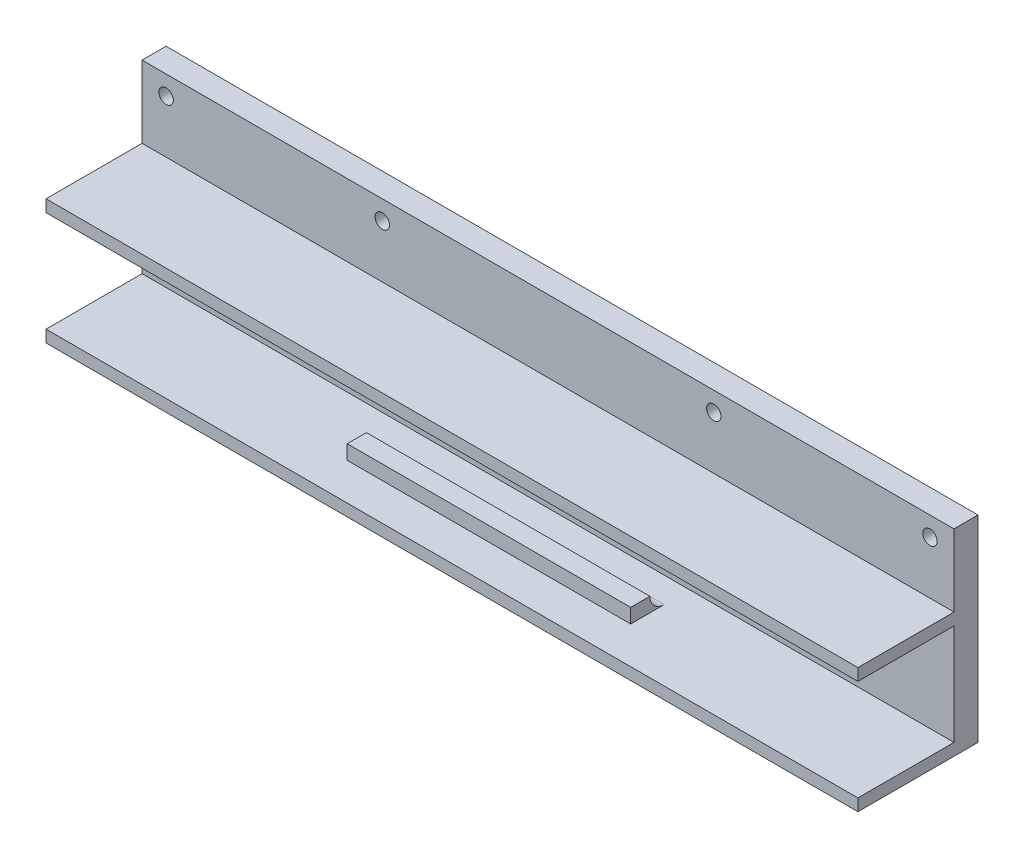
ISO-10303-21;
HEADER;
FILE_DESCRIPTION(('STEP AP214'),'2;1');
FILE_NAME('part.step','',(''),(''),'','','');
FILE_SCHEMA(('AUTOMOTIVE_DESIGN { 1 0 10303 214 1 1 1 1 }'));
ENDSEC;
DATA;
#1=APPLICATION_CONTEXT('core data for automotive mechanical design processes');
#2=APPLICATION_PROTOCOL_DEFINITION('international standard','automotive_design',2000,#1);
#3=PRODUCT_CONTEXT('',#1,'mechanical');
#4=PRODUCT('Part','Part','',(#3));
#5=PRODUCT_RELATED_PRODUCT_CATEGORY('part','',(#4));
#6=PRODUCT_DEFINITION_FORMATION('','',#4);
#7=PRODUCT_DEFINITION_CONTEXT('part definition',#1,'design');
#8=PRODUCT_DEFINITION('design','',#6,#7);
#9=PRODUCT_DEFINITION_SHAPE('','',#8);
#10=(LENGTH_UNIT() NAMED_UNIT(*) SI_UNIT(.MILLI.,.METRE.));
#11=(NAMED_UNIT(*) PLANE_ANGLE_UNIT() SI_UNIT($,.RADIAN.));
#12=(NAMED_UNIT(*) SI_UNIT($,.STERADIAN.) SOLID_ANGLE_UNIT());
#13=UNCERTAINTY_MEASURE_WITH_UNIT(LENGTH_MEASURE(1.E-05),#10,'distance_accuracy_value','');
#14=(GEOMETRIC_REPRESENTATION_CONTEXT(3) GLOBAL_UNCERTAINTY_ASSIGNED_CONTEXT((#13)) GLOBAL_UNIT_ASSIGNED_CONTEXT((#10,
#11,#12)) REPRESENTATION_CONTEXT('',''));
#15=CARTESIAN_POINT('',(0.,0.,0.));
#16=DIRECTION('',(0.,0.,1.));
#17=DIRECTION('',(1.,0.,0.));
#18=AXIS2_PLACEMENT_3D('',#15,#16,#17);
#19=CARTESIAN_POINT('',(-29.5,0.,0.));
#20=DIRECTION('',(-1.,0.,0.));
#21=DIRECTION('',(0.,0.,1.));
#22=AXIS2_PLACEMENT_3D('',#19,#20,#21);
#23=PLANE('',#22);
#24=DIRECTION('',(0.,0.,1.));
#25=VECTOR('',#24,1.);
#26=CARTESIAN_POINT('',(-29.5,0.,17.3));
#27=LINE('',#26,#25);
#28=CARTESIAN_POINT('',(-29.5,0.,13.3));
#29=VERTEX_POINT('',#28);
#30=CARTESIAN_POINT('',(-29.5,0.,17.3));
#31=VERTEX_POINT('',#30);
#32=EDGE_CURVE('E176',#29,#31,#27,.T.);
#33=ORIENTED_EDGE('',*,*,#32,.T.);
#34=DIRECTION('',(0.,1.,0.));
#35=VECTOR('',#34,1.);
#36=CARTESIAN_POINT('',(-29.5,2.99999999999998,17.3));
#37=LINE('',#36,#35);
#38=CARTESIAN_POINT('',(-29.5,2.99999999999998,17.3));
#39=VERTEX_POINT('',#38);
#40=EDGE_CURVE('E586',#31,#39,#37,.T.);
#41=ORIENTED_EDGE('',*,*,#40,.T.);
#42=DIRECTION('',(0.,0.,-1.));
#43=VECTOR('',#42,1.);
#44=CARTESIAN_POINT('',(-29.5,2.99999999999996,25.));
#45=LINE('',#44,#43);
#46=CARTESIAN_POINT('',(-29.5,2.99999999999996,10.3));
#47=VERTEX_POINT('',#46);
#48=EDGE_CURVE('E211',#39,#47,#45,.T.);
#49=ORIENTED_EDGE('',*,*,#48,.T.);
#50=CARTESIAN_POINT('',(-29.5,0.,10.3));
#51=DIRECTION('',(1.,0.,0.));
#52=DIRECTION('',(0.,0.,-1.));
#53=AXIS2_PLACEMENT_3D('',#50,#51,#52);
#54=CIRCLE('',#53,3.);
#55=EDGE_CURVE('E181',#47,#29,#54,.T.);
#56=ORIENTED_EDGE('',*,*,#55,.T.);
#57=EDGE_LOOP('',(#33,#41,#49,#56));
#58=FACE_BOUND('',#57,.T.);
#59=ADVANCED_FACE('F33',(#58),#23,.T.);
#60=CARTESIAN_POINT('',(29.5,0.,0.));
#61=DIRECTION('',(1.,0.,0.));
#62=DIRECTION('',(0.,0.,-1.));
#63=AXIS2_PLACEMENT_3D('',#60,#61,#62);
#64=PLANE('',#63);
#65=DIRECTION('',(0.,0.,1.));
#66=VECTOR('',#65,1.);
#67=CARTESIAN_POINT('',(29.5,0.,17.3));
#68=LINE('',#67,#66);
#69=CARTESIAN_POINT('',(29.5,0.,13.3));
#70=VERTEX_POINT('',#69);
#71=CARTESIAN_POINT('',(29.5,0.,17.3));
#72=VERTEX_POINT('',#71);
#73=EDGE_CURVE('E56',#70,#72,#68,.T.);
#74=ORIENTED_EDGE('',*,*,#73,.F.);
#75=CARTESIAN_POINT('',(29.5,0.,10.3));
#76=DIRECTION('',(1.,0.,0.));
#77=DIRECTION('',(0.,0.,-1.));
#78=AXIS2_PLACEMENT_3D('',#75,#76,#77);
#79=CIRCLE('',#78,3.);
#80=CARTESIAN_POINT('',(29.5,2.99999999999998,10.3));
#81=VERTEX_POINT('',#80);
#82=EDGE_CURVE('E189',#81,#70,#79,.T.);
#83=ORIENTED_EDGE('',*,*,#82,.F.);
#84=DIRECTION('',(0.,0.,1.));
#85=VECTOR('',#84,1.);
#86=CARTESIAN_POINT('',(29.5,2.99999999999998,25.));
#87=LINE('',#86,#85);
#88=CARTESIAN_POINT('',(29.5,2.99999999999998,17.3));
#89=VERTEX_POINT('',#88);
#90=EDGE_CURVE('E199',#81,#89,#87,.T.);
#91=ORIENTED_EDGE('',*,*,#90,.T.);
#92=DIRECTION('',(0.,1.,0.));
#93=VECTOR('',#92,1.);
#94=CARTESIAN_POINT('',(29.5,2.99999999999998,17.3));
#95=LINE('',#94,#93);
#96=EDGE_CURVE('E594',#72,#89,#95,.T.);
#97=ORIENTED_EDGE('',*,*,#96,.F.);
#98=EDGE_LOOP('',(#74,#83,#91,#97));
#99=FACE_BOUND('',#98,.T.);
#100=ADVANCED_FACE('F351',(#99),#64,.T.);
#101=CARTESIAN_POINT('',(-29.5,2.99999999999998,17.3));
#102=DIRECTION('',(0.,0.,-1.));
#103=DIRECTION('',(-1.,0.,0.));
#104=AXIS2_PLACEMENT_3D('',#101,#102,#103);
#105=PLANE('',#104);
#106=ORIENTED_EDGE('',*,*,#40,.F.);
#107=DIRECTION('',(1.,0.,0.));
#108=VECTOR('',#107,1.);
#109=CARTESIAN_POINT('',(-29.5,0.,17.3));
#110=LINE('',#109,#108);
#111=EDGE_CURVE('E587',#31,#72,#110,.T.);
#112=ORIENTED_EDGE('',*,*,#111,.T.);
#113=ORIENTED_EDGE('',*,*,#96,.T.);
#114=DIRECTION('',(1.,0.,0.));
#115=VECTOR('',#114,1.);
#116=CARTESIAN_POINT('',(-29.5,2.99999999999998,17.3));
#117=LINE('',#116,#115);
#118=EDGE_CURVE('E192',#39,#89,#117,.T.);
#119=ORIENTED_EDGE('',*,*,#118,.F.);
#120=EDGE_LOOP('',(#106,#112,#113,#119));
#121=FACE_BOUND('',#120,.T.);
#122=ADVANCED_FACE('F357',(#121),#105,.F.);
#123=CARTESIAN_POINT('',(0.,0.,25.));
#124=DIRECTION('',(0.,0.,-1.));
#125=DIRECTION('',(-1.,0.,0.));
#126=AXIS2_PLACEMENT_3D('',#123,#124,#125);
#127=PLANE('',#126);
#128=DIRECTION('',(-1.,0.,0.));
#129=VECTOR('',#128,1.);
#130=CARTESIAN_POINT('',(-29.5,2.99999999999996,25.));
#131=LINE('',#130,#129);
#132=CARTESIAN_POINT('',(84.5,2.99999999999998,25.));
#133=VERTEX_POINT('',#132);
#134=CARTESIAN_POINT('',(-84.5,2.99999999999996,25.));
#135=VERTEX_POINT('',#134);
#136=EDGE_CURVE('E216',#133,#135,#131,.T.);
#137=ORIENTED_EDGE('',*,*,#136,.F.);
#138=DIRECTION('',(0.,1.,0.));
#139=VECTOR('',#138,1.);
#140=CARTESIAN_POINT('',(84.5,-20.5,25.));
#141=LINE('',#140,#139);
#142=CARTESIAN_POINT('',(84.5,5.49999999999998,25.));
#143=VERTEX_POINT('',#142);
#144=EDGE_CURVE('E239',#133,#143,#141,.T.);
#145=ORIENTED_EDGE('',*,*,#144,.T.);
#146=DIRECTION('',(-1.,0.,0.));
#147=VECTOR('',#146,1.);
#148=CARTESIAN_POINT('',(-84.5,5.49999999999996,25.));
#149=LINE('',#148,#147);
#150=CARTESIAN_POINT('',(-84.5,5.49999999999996,25.));
#151=VERTEX_POINT('',#150);
#152=EDGE_CURVE('E243',#143,#151,#149,.T.);
#153=ORIENTED_EDGE('',*,*,#152,.T.);
#154=DIRECTION('',(0.,-1.,0.));
#155=VECTOR('',#154,1.);
#156=CARTESIAN_POINT('',(-84.5,-20.5,25.));
#157=LINE('',#156,#155);
#158=EDGE_CURVE('E232',#151,#135,#157,.T.);
#159=ORIENTED_EDGE('',*,*,#158,.T.);
#160=EDGE_LOOP('',(#137,#145,#153,#159));
#161=FACE_BOUND('',#160,.T.);
#162=ADVANCED_FACE('F334',(#161),#127,.F.);
#163=CARTESIAN_POINT('',(0.,0.,5.));
#164=DIRECTION('',(0.,0.,-1.));
#165=DIRECTION('',(-1.,0.,0.));
#166=AXIS2_PLACEMENT_3D('',#163,#164,#165);
#167=PLANE('',#166);
#168=CARTESIAN_POINT('',(-79.5,16.5,5.));
#169=DIRECTION('',(0.,0.,1.));
#170=DIRECTION('',(1.,0.,0.));
#171=AXIS2_PLACEMENT_3D('',#168,#169,#170);
#172=CIRCLE('',#171,1.5);
#173=CARTESIAN_POINT('',(-78.,16.5,5.));
#174=VERTEX_POINT('',#173);
#175=EDGE_CURVE('E253',#174,#174,#172,.T.);
#176=ORIENTED_EDGE('',*,*,#175,.F.);
#177=EDGE_LOOP('',(#176));
#178=FACE_BOUND('',#177,.T.);
#179=CARTESIAN_POINT('',(-34.5,16.5,5.));
#180=DIRECTION('',(0.,0.,1.));
#181=DIRECTION('',(1.,0.,0.));
#182=AXIS2_PLACEMENT_3D('',#179,#180,#181);
#183=CIRCLE('',#182,1.5);
#184=CARTESIAN_POINT('',(-33.,16.5,5.));
#185=VERTEX_POINT('',#184);
#186=EDGE_CURVE('E270',#185,#185,#183,.T.);
#187=ORIENTED_EDGE('',*,*,#186,.F.);
#188=EDGE_LOOP('',(#187));
#189=FACE_BOUND('',#188,.T.);
#190=CARTESIAN_POINT('',(34.5,16.5,5.));
#191=DIRECTION('',(0.,0.,1.));
#192=DIRECTION('',(1.,0.,0.));
#193=AXIS2_PLACEMENT_3D('',#190,#191,#192);
#194=CIRCLE('',#193,1.5);
#195=CARTESIAN_POINT('',(36.,16.5,5.));
#196=VERTEX_POINT('',#195);
#197=EDGE_CURVE('E264',#196,#196,#194,.T.);
#198=ORIENTED_EDGE('',*,*,#197,.F.);
#199=EDGE_LOOP('',(#198));
#200=FACE_BOUND('',#199,.T.);
#201=CARTESIAN_POINT('',(79.5,16.5,5.));
#202=DIRECTION('',(0.,0.,1.));
#203=DIRECTION('',(1.,0.,0.));
#204=AXIS2_PLACEMENT_3D('',#201,#202,#203);
#205=CIRCLE('',#204,1.5);
#206=CARTESIAN_POINT('',(81.,16.5,5.));
#207=VERTEX_POINT('',#206);
#208=EDGE_CURVE('E258',#207,#207,#205,.T.);
#209=ORIENTED_EDGE('',*,*,#208,.F.);
#210=EDGE_LOOP('',(#209));
#211=FACE_BOUND('',#210,.T.);
#212=DIRECTION('',(-1.,0.,0.));
#213=VECTOR('',#212,1.);
#214=CARTESIAN_POINT('',(-84.5,5.49999999999996,5.));
#215=LINE('',#214,#213);
#216=CARTESIAN_POINT('',(84.5,5.49999999999997,5.));
#217=VERTEX_POINT('',#216);
#218=CARTESIAN_POINT('',(-84.5,5.49999999999996,5.));
#219=VERTEX_POINT('',#218);
#220=EDGE_CURVE('E226',#217,#219,#215,.T.);
#221=ORIENTED_EDGE('',*,*,#220,.F.);
#222=DIRECTION('',(0.,1.,0.));
#223=VECTOR('',#222,1.);
#224=CARTESIAN_POINT('',(84.5,-20.5,5.));
#225=LINE('',#224,#223);
#226=CARTESIAN_POINT('',(84.5,20.5,5.));
#227=VERTEX_POINT('',#226);
#228=EDGE_CURVE('E278',#217,#227,#225,.T.);
#229=ORIENTED_EDGE('',*,*,#228,.T.);
#230=DIRECTION('',(-1.,0.,0.));
#231=VECTOR('',#230,1.);
#232=CARTESIAN_POINT('',(-84.5,20.5,5.));
#233=LINE('',#232,#231);
#234=CARTESIAN_POINT('',(-84.5,20.5,5.));
#235=VERTEX_POINT('',#234);
#236=EDGE_CURVE('E280',#227,#235,#233,.T.);
#237=ORIENTED_EDGE('',*,*,#236,.T.);
#238=DIRECTION('',(0.,-1.,0.));
#239=VECTOR('',#238,1.);
#240=CARTESIAN_POINT('',(-84.5,-20.5,5.));
#241=LINE('',#240,#239);
#242=EDGE_CURVE('E283',#235,#219,#241,.T.);
#243=ORIENTED_EDGE('',*,*,#242,.T.);
#244=EDGE_LOOP('',(#221,#229,#237,#243));
#245=FACE_BOUND('',#244,.T.);
#246=ADVANCED_FACE('F342',(#178,#189,#200,#211,#245),#167,.F.);
#247=CARTESIAN_POINT('',(84.5,-20.5,5.));
#248=DIRECTION('',(-1.,0.,0.));
#249=DIRECTION('',(0.,0.,1.));
#250=AXIS2_PLACEMENT_3D('',#247,#248,#249);
#251=PLANE('',#250);
#252=ORIENTED_EDGE('',*,*,#144,.F.);
#253=DIRECTION('',(0.,0.,1.));
#254=VECTOR('',#253,1.);
#255=CARTESIAN_POINT('',(84.5,2.99999999999998,25.));
#256=LINE('',#255,#254);
#257=CARTESIAN_POINT('',(84.5,2.99999999999998,5.));
#258=VERTEX_POINT('',#257);
#259=EDGE_CURVE('E200',#258,#133,#256,.T.);
#260=ORIENTED_EDGE('',*,*,#259,.F.);
#261=DIRECTION('',(0.,1.,0.));
#262=VECTOR('',#261,1.);
#263=CARTESIAN_POINT('',(84.5,2.99999999999998,5.));
#264=LINE('',#263,#262);
#265=CARTESIAN_POINT('',(84.5,-18.,4.99999999999999));
#266=VERTEX_POINT('',#265);
#267=EDGE_CURVE('E206',#266,#258,#264,.T.);
#268=ORIENTED_EDGE('',*,*,#267,.F.);
#269=DIRECTION('',(0.,0.,-1.));
#270=VECTOR('',#269,1.);
#271=CARTESIAN_POINT('',(84.5,-18.,25.));
#272=LINE('',#271,#270);
#273=CARTESIAN_POINT('',(84.5,-18.,25.));
#274=VERTEX_POINT('',#273);
#275=EDGE_CURVE('E194',#274,#266,#272,.T.);
#276=ORIENTED_EDGE('',*,*,#275,.F.);
#277=CARTESIAN_POINT('',(84.5,-20.5,25.));
#278=VERTEX_POINT('',#277);
#279=EDGE_CURVE('E240',#278,#274,#141,.T.);
#280=ORIENTED_EDGE('',*,*,#279,.F.);
#281=DIRECTION('',(0.,0.,-1.));
#282=VECTOR('',#281,1.);
#283=CARTESIAN_POINT('',(84.5,-20.5,5.));
#284=LINE('',#283,#282);
#285=CARTESIAN_POINT('',(84.5,-20.5,0.));
#286=VERTEX_POINT('',#285);
#287=EDGE_CURVE('E285',#278,#286,#284,.T.);
#288=ORIENTED_EDGE('',*,*,#287,.T.);
#289=DIRECTION('',(0.,1.,0.));
#290=VECTOR('',#289,1.);
#291=CARTESIAN_POINT('',(84.5,-20.5,0.));
#292=LINE('',#291,#290);
#293=CARTESIAN_POINT('',(84.5,20.5,0.));
#294=VERTEX_POINT('',#293);
#295=EDGE_CURVE('E257',#286,#294,#292,.T.);
#296=ORIENTED_EDGE('',*,*,#295,.T.);
#297=DIRECTION('',(0.,0.,-1.));
#298=VECTOR('',#297,1.);
#299=CARTESIAN_POINT('',(84.5,20.5,5.));
#300=LINE('',#299,#298);
#301=EDGE_CURVE('E11',#227,#294,#300,.T.);
#302=ORIENTED_EDGE('',*,*,#301,.F.);
#303=ORIENTED_EDGE('',*,*,#228,.F.);
#304=DIRECTION('',(0.,0.,-1.));
#305=VECTOR('',#304,1.);
#306=CARTESIAN_POINT('',(84.5,5.49999999999998,25.));
#307=LINE('',#306,#305);
#308=EDGE_CURVE('E250',#143,#217,#307,.T.);
#309=ORIENTED_EDGE('',*,*,#308,.F.);
#310=EDGE_LOOP('',(#252,#260,#268,#276,#280,#288,#296,#302,#303,#309));
#311=FACE_BOUND('',#310,.T.);
#312=ADVANCED_FACE('F35',(#311),#251,.F.);
#313=CARTESIAN_POINT('',(-84.5,20.5,5.));
#314=DIRECTION('',(0.,-1.,0.));
#315=DIRECTION('',(1.,0.,0.));
#316=AXIS2_PLACEMENT_3D('',#313,#314,#315);
#317=PLANE('',#316);
#318=DIRECTION('',(-1.,0.,0.));
#319=VECTOR('',#318,1.);
#320=CARTESIAN_POINT('',(-84.5,20.5,0.));
#321=LINE('',#320,#319);
#322=CARTESIAN_POINT('',(-84.5,20.5,0.));
#323=VERTEX_POINT('',#322);
#324=EDGE_CURVE('E288',#294,#323,#321,.T.);
#325=ORIENTED_EDGE('',*,*,#324,.T.);
#326=DIRECTION('',(0.,0.,-1.));
#327=VECTOR('',#326,1.);
#328=CARTESIAN_POINT('',(-84.5,20.5,5.));
#329=LINE('',#328,#327);
#330=EDGE_CURVE('E41',#235,#323,#329,.T.);
#331=ORIENTED_EDGE('',*,*,#330,.F.);
#332=ORIENTED_EDGE('',*,*,#236,.F.);
#333=ORIENTED_EDGE('',*,*,#301,.T.);
#334=EDGE_LOOP('',(#325,#331,#332,#333));
#335=FACE_BOUND('',#334,.T.);
#336=ADVANCED_FACE('F343',(#335),#317,.F.);
#337=CARTESIAN_POINT('',(-84.5,-20.5,5.));
#338=DIRECTION('',(1.,0.,0.));
#339=DIRECTION('',(0.,0.,-1.));
#340=AXIS2_PLACEMENT_3D('',#337,#338,#339);
#341=PLANE('',#340);
#342=CARTESIAN_POINT('',(-84.5,-18.,25.));
#343=VERTEX_POINT('',#342);
#344=CARTESIAN_POINT('',(-84.5,-20.5,25.));
#345=VERTEX_POINT('',#344);
#346=EDGE_CURVE('E236',#343,#345,#157,.T.);
#347=ORIENTED_EDGE('',*,*,#346,.F.);
#348=DIRECTION('',(0.,0.,1.));
#349=VECTOR('',#348,1.);
#350=CARTESIAN_POINT('',(-84.5,-18.,25.));
#351=LINE('',#350,#349);
#352=CARTESIAN_POINT('',(-84.5,-18.,5.));
#353=VERTEX_POINT('',#352);
#354=EDGE_CURVE('E214',#353,#343,#351,.T.);
#355=ORIENTED_EDGE('',*,*,#354,.F.);
#356=DIRECTION('',(0.,-1.,0.));
#357=VECTOR('',#356,1.);
#358=CARTESIAN_POINT('',(-84.5,-18.,5.));
#359=LINE('',#358,#357);
#360=CARTESIAN_POINT('',(-84.5,2.99999999999995,5.));
#361=VERTEX_POINT('',#360);
#362=EDGE_CURVE('E219',#361,#353,#359,.T.);
#363=ORIENTED_EDGE('',*,*,#362,.F.);
#364=DIRECTION('',(0.,0.,-1.));
#365=VECTOR('',#364,1.);
#366=CARTESIAN_POINT('',(-84.5,2.99999999999996,25.));
#367=LINE('',#366,#365);
#368=EDGE_CURVE('E203',#135,#361,#367,.T.);
#369=ORIENTED_EDGE('',*,*,#368,.F.);
#370=ORIENTED_EDGE('',*,*,#158,.F.);
#371=DIRECTION('',(0.,0.,-1.));
#372=VECTOR('',#371,1.);
#373=CARTESIAN_POINT('',(-84.5,5.49999999999996,25.));
#374=LINE('',#373,#372);
#375=EDGE_CURVE('E245',#151,#219,#374,.T.);
#376=ORIENTED_EDGE('',*,*,#375,.T.);
#377=ORIENTED_EDGE('',*,*,#242,.F.);
#378=ORIENTED_EDGE('',*,*,#330,.T.);
#379=DIRECTION('',(0.,-1.,0.));
#380=VECTOR('',#379,1.);
#381=CARTESIAN_POINT('',(-84.5,-20.5,0.));
#382=LINE('',#381,#380);
#383=CARTESIAN_POINT('',(-84.5,-20.5,0.));
#384=VERTEX_POINT('',#383);
#385=EDGE_CURVE('E290',#323,#384,#382,.T.);
#386=ORIENTED_EDGE('',*,*,#385,.T.);
#387=DIRECTION('',(0.,0.,-1.));
#388=VECTOR('',#387,1.);
#389=CARTESIAN_POINT('',(-84.5,-20.5,5.));
#390=LINE('',#389,#388);
#391=EDGE_CURVE('E295',#345,#384,#390,.T.);
#392=ORIENTED_EDGE('',*,*,#391,.F.);
#393=EDGE_LOOP('',(#347,#355,#363,#369,#370,#376,#377,#378,#386,#392));
#394=FACE_BOUND('',#393,.T.);
#395=ADVANCED_FACE('F303',(#394),#341,.F.);
#396=CARTESIAN_POINT('',(-84.5,-20.5,5.));
#397=DIRECTION('',(0.,1.,0.));
#398=DIRECTION('',(-1.,0.,0.));
#399=AXIS2_PLACEMENT_3D('',#396,#397,#398);
#400=PLANE('',#399);
#401=DIRECTION('',(1.,0.,0.));
#402=VECTOR('',#401,1.);
#403=CARTESIAN_POINT('',(-84.5,-20.5,0.));
#404=LINE('',#403,#402);
#405=EDGE_CURVE('E281',#384,#286,#404,.T.);
#406=ORIENTED_EDGE('',*,*,#405,.T.);
#407=ORIENTED_EDGE('',*,*,#287,.F.);
#408=DIRECTION('',(1.,0.,0.));
#409=VECTOR('',#408,1.);
#410=CARTESIAN_POINT('',(-84.5,-20.5,25.));
#411=LINE('',#410,#409);
#412=EDGE_CURVE('E235',#345,#278,#411,.T.);
#413=ORIENTED_EDGE('',*,*,#412,.F.);
#414=ORIENTED_EDGE('',*,*,#391,.T.);
#415=EDGE_LOOP('',(#406,#407,#413,#414));
#416=FACE_BOUND('',#415,.T.);
#417=ADVANCED_FACE('F312',(#416),#400,.F.);
#418=CARTESIAN_POINT('',(0.,0.,0.));
#419=DIRECTION('',(0.,0.,-1.));
#420=DIRECTION('',(-1.,0.,0.));
#421=AXIS2_PLACEMENT_3D('',#418,#419,#420);
#422=PLANE('',#421);
#423=CARTESIAN_POINT('',(79.5,16.5,0.));
#424=DIRECTION('',(0.,0.,1.));
#425=DIRECTION('',(1.,0.,0.));
#426=AXIS2_PLACEMENT_3D('',#423,#424,#425);
#427=CIRCLE('',#426,1.5);
#428=CARTESIAN_POINT('',(81.,16.5,0.));
#429=VERTEX_POINT('',#428);
#430=EDGE_CURVE('E254',#429,#429,#427,.T.);
#431=ORIENTED_EDGE('',*,*,#430,.T.);
#432=EDGE_LOOP('',(#431));
#433=FACE_BOUND('',#432,.T.);
#434=CARTESIAN_POINT('',(34.5,16.5,0.));
#435=DIRECTION('',(0.,0.,1.));
#436=DIRECTION('',(1.,0.,0.));
#437=AXIS2_PLACEMENT_3D('',#434,#435,#436);
#438=CIRCLE('',#437,1.5);
#439=CARTESIAN_POINT('',(36.,16.5,0.));
#440=VERTEX_POINT('',#439);
#441=EDGE_CURVE('E261',#440,#440,#438,.T.);
#442=ORIENTED_EDGE('',*,*,#441,.T.);
#443=EDGE_LOOP('',(#442));
#444=FACE_BOUND('',#443,.T.);
#445=CARTESIAN_POINT('',(-34.5,16.5,0.));
#446=DIRECTION('',(0.,0.,1.));
#447=DIRECTION('',(1.,0.,0.));
#448=AXIS2_PLACEMENT_3D('',#445,#446,#447);
#449=CIRCLE('',#448,1.5);
#450=CARTESIAN_POINT('',(-33.,16.5,0.));
#451=VERTEX_POINT('',#450);
#452=EDGE_CURVE('E267',#451,#451,#449,.T.);
#453=ORIENTED_EDGE('',*,*,#452,.T.);
#454=EDGE_LOOP('',(#453));
#455=FACE_BOUND('',#454,.T.);
#456=CARTESIAN_POINT('',(-79.5,16.5,0.));
#457=DIRECTION('',(0.,0.,1.));
#458=DIRECTION('',(1.,0.,0.));
#459=AXIS2_PLACEMENT_3D('',#456,#457,#458);
#460=CIRCLE('',#459,1.5);
#461=CARTESIAN_POINT('',(-78.,16.5,0.));
#462=VERTEX_POINT('',#461);
#463=EDGE_CURVE('E273',#462,#462,#460,.T.);
#464=ORIENTED_EDGE('',*,*,#463,.T.);
#465=EDGE_LOOP('',(#464));
#466=FACE_BOUND('',#465,.T.);
#467=ORIENTED_EDGE('',*,*,#295,.F.);
#468=ORIENTED_EDGE('',*,*,#405,.F.);
#469=ORIENTED_EDGE('',*,*,#385,.F.);
#470=ORIENTED_EDGE('',*,*,#324,.F.);
#471=EDGE_LOOP('',(#467,#468,#469,#470));
#472=FACE_BOUND('',#471,.T.);
#473=ADVANCED_FACE('F310',(#433,#444,#455,#466,#472),#422,.T.);
#474=CARTESIAN_POINT('',(-79.5,16.5,0.));
#475=DIRECTION('',(0.,0.,1.));
#476=DIRECTION('',(1.,0.,0.));
#477=AXIS2_PLACEMENT_3D('',#474,#475,#476);
#478=CYLINDRICAL_SURFACE('',#477,1.5);
#479=ORIENTED_EDGE('',*,*,#463,.F.);
#480=EDGE_LOOP('',(#479));
#481=FACE_BOUND('',#480,.T.);
#482=ORIENTED_EDGE('',*,*,#175,.T.);
#483=EDGE_LOOP('',(#482));
#484=FACE_BOUND('',#483,.T.);
#485=ADVANCED_FACE('F392',(#481,#484),#478,.F.);
#486=CARTESIAN_POINT('',(-34.5,16.5,0.));
#487=DIRECTION('',(0.,0.,1.));
#488=DIRECTION('',(1.,0.,0.));
#489=AXIS2_PLACEMENT_3D('',#486,#487,#488);
#490=CYLINDRICAL_SURFACE('',#489,1.5);
#491=ORIENTED_EDGE('',*,*,#452,.F.);
#492=EDGE_LOOP('',(#491));
#493=FACE_BOUND('',#492,.T.);
#494=ORIENTED_EDGE('',*,*,#186,.T.);
#495=EDGE_LOOP('',(#494));
#496=FACE_BOUND('',#495,.T.);
#497=ADVANCED_FACE('F388',(#493,#496),#490,.F.);
#498=CARTESIAN_POINT('',(34.5,16.5,0.));
#499=DIRECTION('',(0.,0.,1.));
#500=DIRECTION('',(1.,0.,0.));
#501=AXIS2_PLACEMENT_3D('',#498,#499,#500);
#502=CYLINDRICAL_SURFACE('',#501,1.5);
#503=ORIENTED_EDGE('',*,*,#441,.F.);
#504=EDGE_LOOP('',(#503));
#505=FACE_BOUND('',#504,.T.);
#506=ORIENTED_EDGE('',*,*,#197,.T.);
#507=EDGE_LOOP('',(#506));
#508=FACE_BOUND('',#507,.T.);
#509=ADVANCED_FACE('F384',(#505,#508),#502,.F.);
#510=CARTESIAN_POINT('',(79.5,16.5,0.));
#511=DIRECTION('',(0.,0.,1.));
#512=DIRECTION('',(1.,0.,0.));
#513=AXIS2_PLACEMENT_3D('',#510,#511,#512);
#514=CYLINDRICAL_SURFACE('',#513,1.5);
#515=ORIENTED_EDGE('',*,*,#430,.F.);
#516=EDGE_LOOP('',(#515));
#517=FACE_BOUND('',#516,.T.);
#518=ORIENTED_EDGE('',*,*,#208,.T.);
#519=EDGE_LOOP('',(#518));
#520=FACE_BOUND('',#519,.T.);
#521=ADVANCED_FACE('F381',(#517,#520),#514,.F.);
#522=CARTESIAN_POINT('',(-84.5,5.49999999999996,25.));
#523=DIRECTION('',(0.,-1.,0.));
#524=DIRECTION('',(1.,0.,0.));
#525=AXIS2_PLACEMENT_3D('',#522,#523,#524);
#526=PLANE('',#525);
#527=ORIENTED_EDGE('',*,*,#220,.T.);
#528=ORIENTED_EDGE('',*,*,#375,.F.);
#529=ORIENTED_EDGE('',*,*,#152,.F.);
#530=ORIENTED_EDGE('',*,*,#308,.T.);
#531=EDGE_LOOP('',(#527,#528,#529,#530));
#532=FACE_BOUND('',#531,.T.);
#533=ADVANCED_FACE('F339',(#532),#526,.F.);
#534=ORIENTED_EDGE('',*,*,#279,.T.);
#535=DIRECTION('',(-1.,0.,0.));
#536=VECTOR('',#535,1.);
#537=CARTESIAN_POINT('',(-29.5,-18.,25.));
#538=LINE('',#537,#536);
#539=EDGE_CURVE('E223',#274,#343,#538,.T.);
#540=ORIENTED_EDGE('',*,*,#539,.T.);
#541=ORIENTED_EDGE('',*,*,#346,.T.);
#542=ORIENTED_EDGE('',*,*,#412,.T.);
#543=EDGE_LOOP('',(#534,#540,#541,#542));
#544=FACE_BOUND('',#543,.T.);
#545=ADVANCED_FACE('F321',(#544),#127,.F.);
#546=CARTESIAN_POINT('',(-29.5,-18.,25.));
#547=DIRECTION('',(0.,-1.,0.));
#548=DIRECTION('',(0.,0.,-1.));
#549=AXIS2_PLACEMENT_3D('',#546,#547,#548);
#550=PLANE('',#549);
#551=DIRECTION('',(1.,0.,0.));
#552=VECTOR('',#551,1.);
#553=CARTESIAN_POINT('',(-29.5,-18.,17.3));
#554=LINE('',#553,#552);
#555=CARTESIAN_POINT('',(-29.5,-18.,17.3));
#556=VERTEX_POINT('',#555);
#557=CARTESIAN_POINT('',(29.5,-18.,17.3));
#558=VERTEX_POINT('',#557);
#559=EDGE_CURVE('E592',#556,#558,#554,.T.);
#560=ORIENTED_EDGE('',*,*,#559,.F.);
#561=DIRECTION('',(0.,0.,1.));
#562=VECTOR('',#561,1.);
#563=CARTESIAN_POINT('',(-29.5,-18.,25.));
#564=LINE('',#563,#562);
#565=CARTESIAN_POINT('',(-29.5,-18.,10.3));
#566=VERTEX_POINT('',#565);
#567=EDGE_CURVE('E213',#566,#556,#564,.T.);
#568=ORIENTED_EDGE('',*,*,#567,.F.);
#569=DIRECTION('',(1.,0.,0.));
#570=VECTOR('',#569,1.);
#571=CARTESIAN_POINT('',(-29.5,-18.,10.3));
#572=LINE('',#571,#570);
#573=CARTESIAN_POINT('',(29.5,-18.,10.3));
#574=VERTEX_POINT('',#573);
#575=EDGE_CURVE('E164',#566,#574,#572,.T.);
#576=ORIENTED_EDGE('',*,*,#575,.T.);
#577=DIRECTION('',(0.,0.,-1.));
#578=VECTOR('',#577,1.);
#579=CARTESIAN_POINT('',(29.5,-18.,25.));
#580=LINE('',#579,#578);
#581=EDGE_CURVE('E197',#558,#574,#580,.T.);
#582=ORIENTED_EDGE('',*,*,#581,.F.);
#583=EDGE_LOOP('',(#560,#568,#576,#582));
#584=FACE_BOUND('',#583,.T.);
#585=ORIENTED_EDGE('',*,*,#354,.T.);
#586=ORIENTED_EDGE('',*,*,#539,.F.);
#587=ORIENTED_EDGE('',*,*,#275,.T.);
#588=DIRECTION('',(-1.,0.,0.));
#589=VECTOR('',#588,1.);
#590=CARTESIAN_POINT('',(-29.5,-18.,5.));
#591=LINE('',#590,#589);
#592=EDGE_CURVE('E227',#266,#353,#591,.T.);
#593=ORIENTED_EDGE('',*,*,#592,.T.);
#594=EDGE_LOOP('',(#585,#586,#587,#593));
#595=FACE_BOUND('',#594,.T.);
#596=ADVANCED_FACE('F326',(#584,#595),#550,.F.);
#597=CARTESIAN_POINT('',(-29.5,-18.,5.));
#598=DIRECTION('',(0.,0.,-1.));
#599=DIRECTION('',(0.,1.,0.));
#600=AXIS2_PLACEMENT_3D('',#597,#598,#599);
#601=PLANE('',#600);
#602=ORIENTED_EDGE('',*,*,#362,.T.);
#603=ORIENTED_EDGE('',*,*,#592,.F.);
#604=ORIENTED_EDGE('',*,*,#267,.T.);
#605=DIRECTION('',(-1.,0.,0.));
#606=VECTOR('',#605,1.);
#607=CARTESIAN_POINT('',(-29.5,2.99999999999995,5.));
#608=LINE('',#607,#606);
#609=EDGE_CURVE('E229',#258,#361,#608,.T.);
#610=ORIENTED_EDGE('',*,*,#609,.T.);
#611=EDGE_LOOP('',(#602,#603,#604,#610));
#612=FACE_BOUND('',#611,.T.);
#613=ADVANCED_FACE('F328',(#612),#601,.F.);
#614=CARTESIAN_POINT('',(-29.5,2.99999999999996,25.));
#615=DIRECTION('',(0.,1.,0.));
#616=DIRECTION('',(0.,0.,1.));
#617=AXIS2_PLACEMENT_3D('',#614,#615,#616);
#618=PLANE('',#617);
#619=ORIENTED_EDGE('',*,*,#48,.F.);
#620=ORIENTED_EDGE('',*,*,#118,.T.);
#621=ORIENTED_EDGE('',*,*,#90,.F.);
#622=DIRECTION('',(1.,0.,0.));
#623=VECTOR('',#622,1.);
#624=CARTESIAN_POINT('',(-29.5,2.99999999999998,10.3));
#625=LINE('',#624,#623);
#626=EDGE_CURVE('E180',#47,#81,#625,.T.);
#627=ORIENTED_EDGE('',*,*,#626,.F.);
#628=EDGE_LOOP('',(#619,#620,#621,#627));
#629=FACE_BOUND('',#628,.T.);
#630=ORIENTED_EDGE('',*,*,#368,.T.);
#631=ORIENTED_EDGE('',*,*,#609,.F.);
#632=ORIENTED_EDGE('',*,*,#259,.T.);
#633=ORIENTED_EDGE('',*,*,#136,.T.);
#634=EDGE_LOOP('',(#630,#631,#632,#633));
#635=FACE_BOUND('',#634,.T.);
#636=ADVANCED_FACE('F331',(#629,#635),#618,.F.);
#637=DIRECTION('',(0.,0.,-1.));
#638=VECTOR('',#637,1.);
#639=CARTESIAN_POINT('',(-29.5,-15.,17.3));
#640=LINE('',#639,#638);
#641=CARTESIAN_POINT('',(-29.5,-15.,17.3));
#642=VERTEX_POINT('',#641);
#643=CARTESIAN_POINT('',(-29.5,-15.,13.3));
#644=VERTEX_POINT('',#643);
#645=EDGE_CURVE('E48',#642,#644,#640,.T.);
#646=ORIENTED_EDGE('',*,*,#645,.T.);
#647=CARTESIAN_POINT('',(-29.5,-15.,10.3));
#648=DIRECTION('',(1.,0.,0.));
#649=DIRECTION('',(0.,0.,1.));
#650=AXIS2_PLACEMENT_3D('',#647,#648,#649);
#651=CIRCLE('',#650,3.);
#652=EDGE_CURVE('E172',#644,#566,#651,.T.);
#653=ORIENTED_EDGE('',*,*,#652,.T.);
#654=ORIENTED_EDGE('',*,*,#567,.T.);
#655=EDGE_CURVE('E175',#556,#642,#37,.T.);
#656=ORIENTED_EDGE('',*,*,#655,.T.);
#657=EDGE_LOOP('',(#646,#653,#654,#656));
#658=FACE_BOUND('',#657,.T.);
#659=ADVANCED_FACE('F170',(#658),#23,.T.);
#660=DIRECTION('',(0.,0.,-1.));
#661=VECTOR('',#660,1.);
#662=CARTESIAN_POINT('',(29.5,-15.,17.3));
#663=LINE('',#662,#661);
#664=CARTESIAN_POINT('',(29.5,-15.,17.3));
#665=VERTEX_POINT('',#664);
#666=CARTESIAN_POINT('',(29.5,-15.,13.3));
#667=VERTEX_POINT('',#666);
#668=EDGE_CURVE('E159',#665,#667,#663,.T.);
#669=ORIENTED_EDGE('',*,*,#668,.F.);
#670=EDGE_CURVE('E590',#558,#665,#95,.T.);
#671=ORIENTED_EDGE('',*,*,#670,.F.);
#672=ORIENTED_EDGE('',*,*,#581,.T.);
#673=CARTESIAN_POINT('',(29.5,-15.,10.3));
#674=DIRECTION('',(1.,0.,0.));
#675=DIRECTION('',(0.,0.,1.));
#676=AXIS2_PLACEMENT_3D('',#673,#674,#675);
#677=CIRCLE('',#676,3.);
#678=EDGE_CURVE('E185',#667,#574,#677,.T.);
#679=ORIENTED_EDGE('',*,*,#678,.F.);
#680=EDGE_LOOP('',(#669,#671,#672,#679));
#681=FACE_BOUND('',#680,.T.);
#682=ADVANCED_FACE('F360',(#681),#64,.T.);
#683=CARTESIAN_POINT('',(-29.5,-15.,10.3));
#684=DIRECTION('',(1.,0.,0.));
#685=DIRECTION('',(0.,0.,-1.));
#686=AXIS2_PLACEMENT_3D('',#683,#684,#685);
#687=CYLINDRICAL_SURFACE('',#686,3.);
#688=ORIENTED_EDGE('',*,*,#678,.T.);
#689=ORIENTED_EDGE('',*,*,#575,.F.);
#690=ORIENTED_EDGE('',*,*,#652,.F.);
#691=DIRECTION('',(1.,0.,0.));
#692=VECTOR('',#691,1.);
#693=CARTESIAN_POINT('',(-29.5,-15.,13.3));
#694=LINE('',#693,#692);
#695=EDGE_CURVE('E156',#644,#667,#694,.T.);
#696=ORIENTED_EDGE('',*,*,#695,.T.);
#697=EDGE_LOOP('',(#688,#689,#690,#696));
#698=FACE_BOUND('',#697,.T.);
#699=ADVANCED_FACE('F178',(#698),#687,.F.);
#700=CARTESIAN_POINT('',(-29.5,0.,10.3));
#701=DIRECTION('',(1.,0.,0.));
#702=DIRECTION('',(0.,0.,-1.));
#703=AXIS2_PLACEMENT_3D('',#700,#701,#702);
#704=CYLINDRICAL_SURFACE('',#703,3.);
#705=ORIENTED_EDGE('',*,*,#82,.T.);
#706=DIRECTION('',(1.,0.,0.));
#707=VECTOR('',#706,1.);
#708=CARTESIAN_POINT('',(-29.5,0.,13.3));
#709=LINE('',#708,#707);
#710=EDGE_CURVE('E165',#29,#70,#709,.T.);
#711=ORIENTED_EDGE('',*,*,#710,.F.);
#712=ORIENTED_EDGE('',*,*,#55,.F.);
#713=ORIENTED_EDGE('',*,*,#626,.T.);
#714=EDGE_LOOP('',(#705,#711,#712,#713));
#715=FACE_BOUND('',#714,.T.);
#716=ADVANCED_FACE('F530',(#715),#704,.F.);
#717=ORIENTED_EDGE('',*,*,#670,.T.);
#718=DIRECTION('',(1.,0.,0.));
#719=VECTOR('',#718,1.);
#720=CARTESIAN_POINT('',(-29.5,-15.,17.3));
#721=LINE('',#720,#719);
#722=EDGE_CURVE('E597',#642,#665,#721,.T.);
#723=ORIENTED_EDGE('',*,*,#722,.F.);
#724=ORIENTED_EDGE('',*,*,#655,.F.);
#725=ORIENTED_EDGE('',*,*,#559,.T.);
#726=EDGE_LOOP('',(#717,#723,#724,#725));
#727=FACE_BOUND('',#726,.T.);
#728=ADVANCED_FACE('F538',(#727),#105,.F.);
#729=CARTESIAN_POINT('',(-29.5,-15.,17.3));
#730=DIRECTION('',(0.,-1.,0.));
#731=DIRECTION('',(0.,0.,-1.));
#732=AXIS2_PLACEMENT_3D('',#729,#730,#731);
#733=PLANE('',#732);
#734=ORIENTED_EDGE('',*,*,#668,.T.);
#735=ORIENTED_EDGE('',*,*,#695,.F.);
#736=ORIENTED_EDGE('',*,*,#645,.F.);
#737=ORIENTED_EDGE('',*,*,#722,.T.);
#738=EDGE_LOOP('',(#734,#735,#736,#737));
#739=FACE_BOUND('',#738,.T.);
#740=ADVANCED_FACE('F157',(#739),#733,.F.);
#741=CARTESIAN_POINT('',(-29.5,0.,17.3));
#742=DIRECTION('',(0.,1.,0.));
#743=DIRECTION('',(0.,0.,1.));
#744=AXIS2_PLACEMENT_3D('',#741,#742,#743);
#745=PLANE('',#744);
#746=ORIENTED_EDGE('',*,*,#73,.T.);
#747=ORIENTED_EDGE('',*,*,#111,.F.);
#748=ORIENTED_EDGE('',*,*,#32,.F.);
#749=ORIENTED_EDGE('',*,*,#710,.T.);
#750=EDGE_LOOP('',(#746,#747,#748,#749));
#751=FACE_BOUND('',#750,.T.);
#752=ADVANCED_FACE('F559',(#751),#745,.F.);
#753=CLOSED_SHELL('',(#59,#100,#122,#162,#246,#312,#336,#395,#417,#473,#485,#497,#509,#521,#533,
#545,#596,#613,#636,#659,#682,#699,#716,#728,#740,#752));
#754=MANIFOLD_SOLID_BREP('B2',#753);
#755=ADVANCED_BREP_SHAPE_REPRESENTATION('',(#18,#754),#14);
#756=SHAPE_DEFINITION_REPRESENTATION(#9,#755);
ENDSEC;
END-ISO-10303-21;
